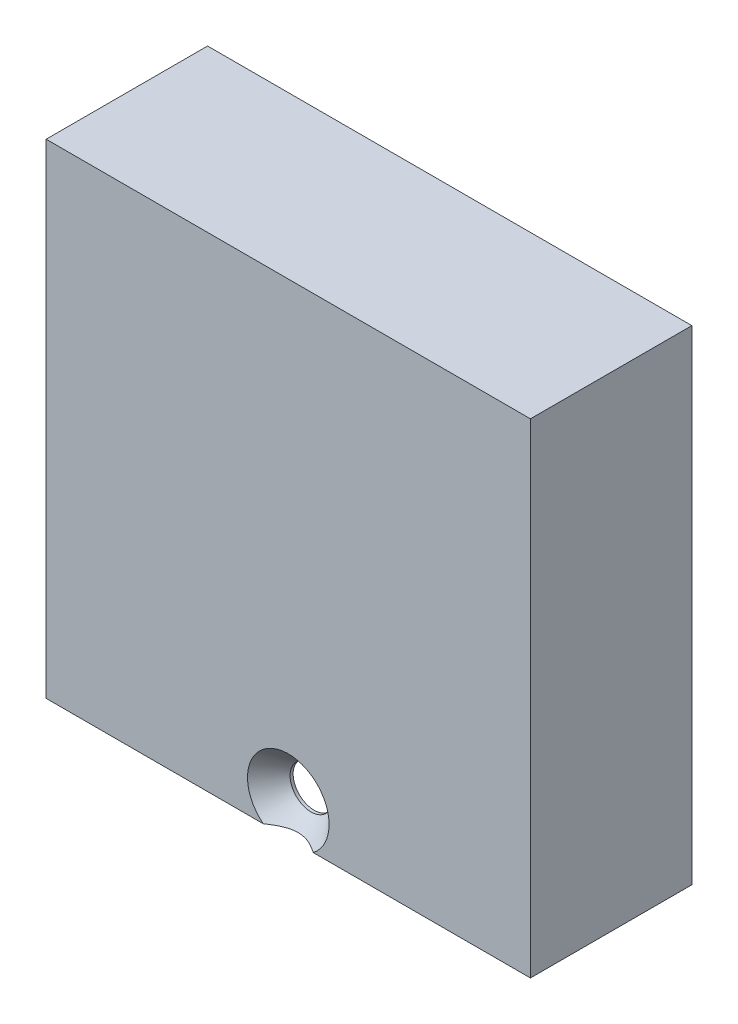
ISO-10303-21;
HEADER;
FILE_DESCRIPTION(('STEP AP214'),'2;1');
FILE_NAME('part.step','',(''),(''),'','','');
FILE_SCHEMA(('AUTOMOTIVE_DESIGN { 1 0 10303 214 1 1 1 1 }'));
ENDSEC;
DATA;
#1=APPLICATION_CONTEXT('core data for automotive mechanical design processes');
#2=APPLICATION_PROTOCOL_DEFINITION('international standard','automotive_design',2000,#1);
#3=PRODUCT_CONTEXT('',#1,'mechanical');
#4=PRODUCT('Part','Part','',(#3));
#5=PRODUCT_RELATED_PRODUCT_CATEGORY('part','',(#4));
#6=PRODUCT_DEFINITION_FORMATION('','',#4);
#7=PRODUCT_DEFINITION_CONTEXT('part definition',#1,'design');
#8=PRODUCT_DEFINITION('design','',#6,#7);
#9=PRODUCT_DEFINITION_SHAPE('','',#8);
#10=(LENGTH_UNIT() NAMED_UNIT(*) SI_UNIT(.MILLI.,.METRE.));
#11=(NAMED_UNIT(*) PLANE_ANGLE_UNIT() SI_UNIT($,.RADIAN.));
#12=(NAMED_UNIT(*) SI_UNIT($,.STERADIAN.) SOLID_ANGLE_UNIT());
#13=UNCERTAINTY_MEASURE_WITH_UNIT(LENGTH_MEASURE(1.E-05),#10,'distance_accuracy_value','');
#14=(GEOMETRIC_REPRESENTATION_CONTEXT(3) GLOBAL_UNCERTAINTY_ASSIGNED_CONTEXT((#13)) GLOBAL_UNIT_ASSIGNED_CONTEXT((#10,
#11,#12)) REPRESENTATION_CONTEXT('',''));
#15=CARTESIAN_POINT('',(0.,0.,0.));
#16=DIRECTION('',(0.,0.,1.));
#17=DIRECTION('',(1.,0.,0.));
#18=AXIS2_PLACEMENT_3D('',#15,#16,#17);
#19=CARTESIAN_POINT('',(0.,0.,10.));
#20=DIRECTION('',(0.,0.,-1.));
#21=DIRECTION('',(-1.,0.,0.));
#22=AXIS2_PLACEMENT_3D('',#19,#20,#21);
#23=PLANE('',#22);
#24=CARTESIAN_POINT('',(15.,2.,10.));
#25=DIRECTION('',(0.,0.,1.));
#26=DIRECTION('',(1.,0.,0.));
#27=AXIS2_PLACEMENT_3D('',#24,#25,#26);
#28=CIRCLE('',#27,2.5273);
#29=CARTESIAN_POINT('',(16.5450712896174,0.,10.));
#30=VERTEX_POINT('',#29);
#31=CARTESIAN_POINT('',(13.4549287103826,0.,10.));
#32=VERTEX_POINT('',#31);
#33=EDGE_CURVE('E47',#30,#32,#28,.T.);
#34=ORIENTED_EDGE('',*,*,#33,.F.);
#35=DIRECTION('',(1.,0.,0.));
#36=VECTOR('',#35,1.);
#37=CARTESIAN_POINT('',(0.,0.,10.));
#38=LINE('',#37,#36);
#39=CARTESIAN_POINT('',(30.,0.,10.));
#40=VERTEX_POINT('',#39);
#41=EDGE_CURVE('E153',#30,#40,#38,.T.);
#42=ORIENTED_EDGE('',*,*,#41,.T.);
#43=DIRECTION('',(0.,1.,0.));
#44=VECTOR('',#43,1.);
#45=CARTESIAN_POINT('',(30.,0.,10.));
#46=LINE('',#45,#44);
#47=CARTESIAN_POINT('',(30.,30.,10.));
#48=VERTEX_POINT('',#47);
#49=EDGE_CURVE('E165',#40,#48,#46,.T.);
#50=ORIENTED_EDGE('',*,*,#49,.T.);
#51=DIRECTION('',(-1.,0.,0.));
#52=VECTOR('',#51,1.);
#53=CARTESIAN_POINT('',(0.,30.,10.));
#54=LINE('',#53,#52);
#55=CARTESIAN_POINT('',(0.,30.,10.));
#56=VERTEX_POINT('',#55);
#57=EDGE_CURVE('E171',#48,#56,#54,.T.);
#58=ORIENTED_EDGE('',*,*,#57,.T.);
#59=DIRECTION('',(0.,-1.,0.));
#60=VECTOR('',#59,1.);
#61=CARTESIAN_POINT('',(0.,0.,10.));
#62=LINE('',#61,#60);
#63=CARTESIAN_POINT('',(0.,0.,10.));
#64=VERTEX_POINT('',#63);
#65=EDGE_CURVE('E163',#56,#64,#62,.T.);
#66=ORIENTED_EDGE('',*,*,#65,.T.);
#67=EDGE_CURVE('E156',#64,#32,#38,.T.);
#68=ORIENTED_EDGE('',*,*,#67,.T.);
#69=EDGE_LOOP('',(#34,#42,#50,#58,#66,#68));
#70=FACE_BOUND('',#69,.T.);
#71=ADVANCED_FACE('F32',(#70),#23,.F.);
#72=CARTESIAN_POINT('',(15.,15.5,-27.7353564967173));
#73=DIRECTION('',(0.,0.,1.));
#74=DIRECTION('',(1.,0.,0.));
#75=AXIS2_PLACEMENT_3D('',#72,#73,#74);
#76=CYLINDRICAL_SURFACE('',#75,12.25);
#77=DIRECTION('',(0.,0.,1.));
#78=VECTOR('',#77,1.);
#79=CARTESIAN_POINT('',(27.25,15.5,-27.7353564967173));
#80=LINE('',#79,#78);
#81=CARTESIAN_POINT('',(27.25,15.5,0.));
#82=VERTEX_POINT('',#81);
#83=CARTESIAN_POINT('',(27.25,15.5,5.20000000000001));
#84=VERTEX_POINT('',#83);
#85=EDGE_CURVE('E287',#82,#84,#80,.T.);
#86=ORIENTED_EDGE('',*,*,#85,.T.);
#87=CARTESIAN_POINT('',(15.,15.5,5.2));
#88=DIRECTION('',(0.,0.,1.));
#89=DIRECTION('',(1.,0.,0.));
#90=AXIS2_PLACEMENT_3D('',#87,#88,#89);
#91=CIRCLE('',#90,12.25);
#92=CARTESIAN_POINT('',(2.74999999999999,15.5,5.2));
#93=VERTEX_POINT('',#92);
#94=EDGE_CURVE('E298',#84,#93,#91,.T.);
#95=ORIENTED_EDGE('',*,*,#94,.T.);
#96=DIRECTION('',(0.,0.,1.));
#97=VECTOR('',#96,1.);
#98=CARTESIAN_POINT('',(2.74999999999999,15.5,-27.7353564967173));
#99=LINE('',#98,#97);
#100=CARTESIAN_POINT('',(2.74999999999999,15.5,0.));
#101=VERTEX_POINT('',#100);
#102=EDGE_CURVE('E292',#101,#93,#99,.T.);
#103=ORIENTED_EDGE('',*,*,#102,.F.);
#104=CARTESIAN_POINT('',(15.,15.5,0.));
#105=DIRECTION('',(0.,0.,-1.));
#106=DIRECTION('',(-1.,0.,0.));
#107=AXIS2_PLACEMENT_3D('',#104,#105,#106);
#108=CIRCLE('',#107,12.25);
#109=EDGE_CURVE('E288',#82,#101,#108,.F.);
#110=ORIENTED_EDGE('',*,*,#109,.F.);
#111=EDGE_LOOP('',(#86,#95,#103,#110));
#112=FACE_BOUND('',#111,.T.);
#113=ADVANCED_FACE('F216',(#112),#76,.F.);
#114=CARTESIAN_POINT('',(2.74999999999999,15.5,6.2));
#115=VERTEX_POINT('',#114);
#116=CARTESIAN_POINT('',(2.74999999999999,15.5,8.4));
#117=VERTEX_POINT('',#116);
#118=EDGE_CURVE('E286',#115,#117,#99,.T.);
#119=ORIENTED_EDGE('',*,*,#118,.F.);
#120=CARTESIAN_POINT('',(15.,15.5,6.20000000000001));
#121=DIRECTION('',(0.,0.,-1.));
#122=DIRECTION('',(-1.,0.,0.));
#123=AXIS2_PLACEMENT_3D('',#120,#121,#122);
#124=CIRCLE('',#123,12.25);
#125=CARTESIAN_POINT('',(27.25,15.5,6.2));
#126=VERTEX_POINT('',#125);
#127=EDGE_CURVE('E291',#115,#126,#124,.T.);
#128=ORIENTED_EDGE('',*,*,#127,.T.);
#129=CARTESIAN_POINT('',(27.25,15.5,8.4));
#130=VERTEX_POINT('',#129);
#131=EDGE_CURVE('E282',#126,#130,#80,.T.);
#132=ORIENTED_EDGE('',*,*,#131,.T.);
#133=CARTESIAN_POINT('',(15.,15.5,8.4));
#134=DIRECTION('',(0.,0.,1.));
#135=DIRECTION('',(1.,0.,0.));
#136=AXIS2_PLACEMENT_3D('',#133,#134,#135);
#137=CIRCLE('',#136,12.25);
#138=EDGE_CURVE('E283',#130,#117,#137,.T.);
#139=ORIENTED_EDGE('',*,*,#138,.T.);
#140=EDGE_LOOP('',(#119,#128,#132,#139));
#141=FACE_BOUND('',#140,.T.);
#142=ADVANCED_FACE('F249',(#141),#76,.F.);
#143=CARTESIAN_POINT('',(3.34999999999999,28.5,5.2));
#144=DIRECTION('',(-1.,0.,0.));
#145=DIRECTION('',(0.,0.,1.));
#146=AXIS2_PLACEMENT_3D('',#143,#144,#145);
#147=PLANE('',#146);
#148=DIRECTION('',(0.,0.,-1.));
#149=VECTOR('',#148,1.);
#150=CARTESIAN_POINT('',(3.34999999999999,0.,5.2));
#151=LINE('',#150,#149);
#152=CARTESIAN_POINT('',(3.34999999999999,0.,6.2));
#153=VERTEX_POINT('',#152);
#154=CARTESIAN_POINT('',(3.34999999999999,0.,5.2));
#155=VERTEX_POINT('',#154);
#156=EDGE_CURVE('E325',#153,#155,#151,.T.);
#157=ORIENTED_EDGE('',*,*,#156,.T.);
#158=DIRECTION('',(0.,-1.,0.));
#159=VECTOR('',#158,1.);
#160=CARTESIAN_POINT('',(3.34999999999999,28.5,5.2));
#161=LINE('',#160,#159);
#162=CARTESIAN_POINT('',(3.34999999999999,17.0297058540778,5.2));
#163=VERTEX_POINT('',#162);
#164=EDGE_CURVE('E54',#163,#155,#161,.T.);
#165=ORIENTED_EDGE('',*,*,#164,.F.);
#166=DIRECTION('',(0.,0.,-1.));
#167=VECTOR('',#166,1.);
#168=CARTESIAN_POINT('',(3.35000000000001,17.029705854078,40.2139893245156));
#169=LINE('',#168,#167);
#170=CARTESIAN_POINT('',(3.35,17.0297058540778,6.2));
#171=VERTEX_POINT('',#170);
#172=EDGE_CURVE('E280',#163,#171,#169,.F.);
#173=ORIENTED_EDGE('',*,*,#172,.T.);
#174=DIRECTION('',(0.,-1.,0.));
#175=VECTOR('',#174,1.);
#176=CARTESIAN_POINT('',(3.34999999999999,28.5,6.2));
#177=LINE('',#176,#175);
#178=EDGE_CURVE('E338',#171,#153,#177,.T.);
#179=ORIENTED_EDGE('',*,*,#178,.T.);
#180=EDGE_LOOP('',(#157,#165,#173,#179));
#181=FACE_BOUND('',#180,.T.);
#182=ADVANCED_FACE('F240',(#181),#147,.F.);
#183=CARTESIAN_POINT('',(2.74999999999999,28.5,8.4));
#184=DIRECTION('',(0.,0.,1.));
#185=DIRECTION('',(1.,0.,0.));
#186=AXIS2_PLACEMENT_3D('',#183,#184,#185);
#187=PLANE('',#186);
#188=CARTESIAN_POINT('',(15.,2.,8.4));
#189=DIRECTION('',(0.,0.,1.));
#190=DIRECTION('',(1.,0.,0.));
#191=AXIS2_PLACEMENT_3D('',#188,#189,#190);
#192=CIRCLE('',#191,1.29999739999999);
#193=CARTESIAN_POINT('',(16.2999974,2.,8.4));
#194=VERTEX_POINT('',#193);
#195=EDGE_CURVE('E36',#194,#194,#192,.T.);
#196=ORIENTED_EDGE('',*,*,#195,.T.);
#197=EDGE_LOOP('',(#196));
#198=FACE_BOUND('',#197,.T.);
#199=ORIENTED_EDGE('',*,*,#138,.F.);
#200=DIRECTION('',(0.,-1.,0.));
#201=VECTOR('',#200,1.);
#202=CARTESIAN_POINT('',(27.25,28.5,8.4));
#203=LINE('',#202,#201);
#204=CARTESIAN_POINT('',(27.25,0.,8.4));
#205=VERTEX_POINT('',#204);
#206=EDGE_CURVE('E344',#130,#205,#203,.T.);
#207=ORIENTED_EDGE('',*,*,#206,.T.);
#208=DIRECTION('',(-1.,0.,0.));
#209=VECTOR('',#208,1.);
#210=CARTESIAN_POINT('',(2.74999999999999,0.,8.4));
#211=LINE('',#210,#209);
#212=CARTESIAN_POINT('',(2.74999999999999,0.,8.4));
#213=VERTEX_POINT('',#212);
#214=EDGE_CURVE('E316',#205,#213,#211,.T.);
#215=ORIENTED_EDGE('',*,*,#214,.T.);
#216=DIRECTION('',(0.,-1.,0.));
#217=VECTOR('',#216,1.);
#218=CARTESIAN_POINT('',(2.74999999999999,28.5,8.4));
#219=LINE('',#218,#217);
#220=EDGE_CURVE('E342',#117,#213,#219,.T.);
#221=ORIENTED_EDGE('',*,*,#220,.F.);
#222=EDGE_LOOP('',(#199,#207,#215,#221));
#223=FACE_BOUND('',#222,.T.);
#224=ADVANCED_FACE('F236',(#198,#223),#187,.F.);
#225=CARTESIAN_POINT('',(27.25,28.5,8.4));
#226=DIRECTION('',(1.,0.,0.));
#227=DIRECTION('',(0.,0.,-1.));
#228=AXIS2_PLACEMENT_3D('',#225,#226,#227);
#229=PLANE('',#228);
#230=ORIENTED_EDGE('',*,*,#131,.F.);
#231=DIRECTION('',(0.,-1.,0.));
#232=VECTOR('',#231,1.);
#233=CARTESIAN_POINT('',(27.25,28.5,6.2));
#234=LINE('',#233,#232);
#235=CARTESIAN_POINT('',(27.25,0.,6.2));
#236=VERTEX_POINT('',#235);
#237=EDGE_CURVE('E346',#126,#236,#234,.T.);
#238=ORIENTED_EDGE('',*,*,#237,.T.);
#239=DIRECTION('',(0.,0.,1.));
#240=VECTOR('',#239,1.);
#241=CARTESIAN_POINT('',(27.25,0.,8.4));
#242=LINE('',#241,#240);
#243=EDGE_CURVE('E313',#236,#205,#242,.T.);
#244=ORIENTED_EDGE('',*,*,#243,.T.);
#245=ORIENTED_EDGE('',*,*,#206,.F.);
#246=EDGE_LOOP('',(#230,#238,#244,#245));
#247=FACE_BOUND('',#246,.T.);
#248=ADVANCED_FACE('F232',(#247),#229,.F.);
#249=CARTESIAN_POINT('',(27.25,28.5,6.2));
#250=DIRECTION('',(0.,0.,-1.));
#251=DIRECTION('',(-1.,0.,0.));
#252=AXIS2_PLACEMENT_3D('',#249,#250,#251);
#253=PLANE('',#252);
#254=DIRECTION('',(1.,0.,0.));
#255=VECTOR('',#254,1.);
#256=CARTESIAN_POINT('',(27.25,0.,6.2));
#257=LINE('',#256,#255);
#258=CARTESIAN_POINT('',(26.65,0.,6.2));
#259=VERTEX_POINT('',#258);
#260=EDGE_CURVE('E310',#259,#236,#257,.T.);
#261=ORIENTED_EDGE('',*,*,#260,.T.);
#262=ORIENTED_EDGE('',*,*,#237,.F.);
#263=ORIENTED_EDGE('',*,*,#127,.F.);
#264=DIRECTION('',(0.,-1.,0.));
#265=VECTOR('',#264,1.);
#266=CARTESIAN_POINT('',(2.74999999999999,28.5,6.2));
#267=LINE('',#266,#265);
#268=CARTESIAN_POINT('',(2.74999999999999,0.,6.2));
#269=VERTEX_POINT('',#268);
#270=EDGE_CURVE('E340',#115,#269,#267,.T.);
#271=ORIENTED_EDGE('',*,*,#270,.T.);
#272=DIRECTION('',(1.,0.,0.));
#273=VECTOR('',#272,1.);
#274=CARTESIAN_POINT('',(3.34999999999999,0.,6.2));
#275=LINE('',#274,#273);
#276=EDGE_CURVE('E322',#269,#153,#275,.T.);
#277=ORIENTED_EDGE('',*,*,#276,.T.);
#278=ORIENTED_EDGE('',*,*,#178,.F.);
#279=CARTESIAN_POINT('',(15.,15.5,6.2));
#280=DIRECTION('',(0.,0.,-1.));
#281=DIRECTION('',(-1.,0.,0.));
#282=AXIS2_PLACEMENT_3D('',#279,#280,#281);
#283=CIRCLE('',#282,11.75);
#284=CARTESIAN_POINT('',(26.65,17.0297058540778,6.2));
#285=VERTEX_POINT('',#284);
#286=EDGE_CURVE('E272',#171,#285,#283,.T.);
#287=ORIENTED_EDGE('',*,*,#286,.T.);
#288=DIRECTION('',(0.,-1.,0.));
#289=VECTOR('',#288,1.);
#290=CARTESIAN_POINT('',(26.65,28.5,6.2));
#291=LINE('',#290,#289);
#292=EDGE_CURVE('E348',#285,#259,#291,.T.);
#293=ORIENTED_EDGE('',*,*,#292,.T.);
#294=EDGE_LOOP('',(#261,#262,#263,#271,#277,#278,#287,#293));
#295=FACE_BOUND('',#294,.T.);
#296=ADVANCED_FACE('F228',(#295),#253,.F.);
#297=CARTESIAN_POINT('',(26.65,28.5,6.2));
#298=DIRECTION('',(1.,0.,0.));
#299=DIRECTION('',(0.,0.,-1.));
#300=AXIS2_PLACEMENT_3D('',#297,#298,#299);
#301=PLANE('',#300);
#302=DIRECTION('',(0.,0.,1.));
#303=VECTOR('',#302,1.);
#304=CARTESIAN_POINT('',(26.65,0.,6.2));
#305=LINE('',#304,#303);
#306=CARTESIAN_POINT('',(26.65,0.,5.20000000000001));
#307=VERTEX_POINT('',#306);
#308=EDGE_CURVE('E307',#307,#259,#305,.T.);
#309=ORIENTED_EDGE('',*,*,#308,.T.);
#310=ORIENTED_EDGE('',*,*,#292,.F.);
#311=DIRECTION('',(0.,0.,-1.));
#312=VECTOR('',#311,1.);
#313=CARTESIAN_POINT('',(26.65,17.0297058540779,40.2139893245156));
#314=LINE('',#313,#312);
#315=CARTESIAN_POINT('',(26.65,17.0297058540778,5.2));
#316=VERTEX_POINT('',#315);
#317=EDGE_CURVE('E277',#285,#316,#314,.T.);
#318=ORIENTED_EDGE('',*,*,#317,.T.);
#319=DIRECTION('',(0.,-1.,0.));
#320=VECTOR('',#319,1.);
#321=CARTESIAN_POINT('',(26.65,28.5,5.20000000000001));
#322=LINE('',#321,#320);
#323=EDGE_CURVE('E350',#316,#307,#322,.T.);
#324=ORIENTED_EDGE('',*,*,#323,.T.);
#325=EDGE_LOOP('',(#309,#310,#318,#324));
#326=FACE_BOUND('',#325,.T.);
#327=ADVANCED_FACE('F224',(#326),#301,.F.);
#328=CARTESIAN_POINT('',(26.65,28.5,5.20000000000001));
#329=DIRECTION('',(0.,0.,1.));
#330=DIRECTION('',(1.,0.,0.));
#331=AXIS2_PLACEMENT_3D('',#328,#329,#330);
#332=PLANE('',#331);
#333=DIRECTION('',(-1.,0.,0.));
#334=VECTOR('',#333,1.);
#335=CARTESIAN_POINT('',(26.65,0.,5.20000000000001));
#336=LINE('',#335,#334);
#337=CARTESIAN_POINT('',(27.25,0.,5.20000000000001));
#338=VERTEX_POINT('',#337);
#339=EDGE_CURVE('E304',#338,#307,#336,.T.);
#340=ORIENTED_EDGE('',*,*,#339,.T.);
#341=ORIENTED_EDGE('',*,*,#323,.F.);
#342=CARTESIAN_POINT('',(15.,15.5,5.20000000000001));
#343=DIRECTION('',(0.,0.,1.));
#344=DIRECTION('',(1.,0.,0.));
#345=AXIS2_PLACEMENT_3D('',#342,#343,#344);
#346=CIRCLE('',#345,11.75);
#347=EDGE_CURVE('E270',#316,#163,#346,.T.);
#348=ORIENTED_EDGE('',*,*,#347,.T.);
#349=ORIENTED_EDGE('',*,*,#164,.T.);
#350=DIRECTION('',(-1.,0.,0.));
#351=VECTOR('',#350,1.);
#352=CARTESIAN_POINT('',(2.74999999999999,0.,5.2));
#353=LINE('',#352,#351);
#354=CARTESIAN_POINT('',(2.74999999999999,0.,5.2));
#355=VERTEX_POINT('',#354);
#356=EDGE_CURVE('E327',#155,#355,#353,.T.);
#357=ORIENTED_EDGE('',*,*,#356,.T.);
#358=DIRECTION('',(0.,-1.,0.));
#359=VECTOR('',#358,1.);
#360=CARTESIAN_POINT('',(2.74999999999999,28.5,5.2));
#361=LINE('',#360,#359);
#362=EDGE_CURVE('E335',#93,#355,#361,.T.);
#363=ORIENTED_EDGE('',*,*,#362,.F.);
#364=ORIENTED_EDGE('',*,*,#94,.F.);
#365=DIRECTION('',(0.,-1.,0.));
#366=VECTOR('',#365,1.);
#367=CARTESIAN_POINT('',(27.25,28.5,5.20000000000001));
#368=LINE('',#367,#366);
#369=EDGE_CURVE('E352',#84,#338,#368,.T.);
#370=ORIENTED_EDGE('',*,*,#369,.T.);
#371=EDGE_LOOP('',(#340,#341,#348,#349,#357,#363,#364,#370));
#372=FACE_BOUND('',#371,.T.);
#373=ADVANCED_FACE('F220',(#372),#332,.F.);
#374=CARTESIAN_POINT('',(27.25,28.5,5.20000000000001));
#375=DIRECTION('',(1.,0.,0.));
#376=DIRECTION('',(0.,0.,-1.));
#377=AXIS2_PLACEMENT_3D('',#374,#375,#376);
#378=PLANE('',#377);
#379=ORIENTED_EDGE('',*,*,#85,.F.);
#380=DIRECTION('',(0.,-1.,0.));
#381=VECTOR('',#380,1.);
#382=CARTESIAN_POINT('',(27.25,28.5,0.));
#383=LINE('',#382,#381);
#384=CARTESIAN_POINT('',(27.25,0.,0.));
#385=VERTEX_POINT('',#384);
#386=EDGE_CURVE('E333',#82,#385,#383,.T.);
#387=ORIENTED_EDGE('',*,*,#386,.T.);
#388=DIRECTION('',(0.,0.,1.));
#389=VECTOR('',#388,1.);
#390=CARTESIAN_POINT('',(27.25,0.,5.20000000000001));
#391=LINE('',#390,#389);
#392=EDGE_CURVE('E301',#385,#338,#391,.T.);
#393=ORIENTED_EDGE('',*,*,#392,.T.);
#394=ORIENTED_EDGE('',*,*,#369,.F.);
#395=EDGE_LOOP('',(#379,#387,#393,#394));
#396=FACE_BOUND('',#395,.T.);
#397=ADVANCED_FACE('F217',(#396),#378,.F.);
#398=CARTESIAN_POINT('',(0.,0.,10.));
#399=DIRECTION('',(1.,0.,0.));
#400=DIRECTION('',(0.,0.,-1.));
#401=AXIS2_PLACEMENT_3D('',#398,#399,#400);
#402=PLANE('',#401);
#403=DIRECTION('',(0.,0.,-1.));
#404=VECTOR('',#403,1.);
#405=CARTESIAN_POINT('',(0.,30.,10.));
#406=LINE('',#405,#404);
#407=CARTESIAN_POINT('',(0.,30.,0.));
#408=VERTEX_POINT('',#407);
#409=EDGE_CURVE('E173',#56,#408,#406,.T.);
#410=ORIENTED_EDGE('',*,*,#409,.T.);
#411=DIRECTION('',(0.,-1.,0.));
#412=VECTOR('',#411,1.);
#413=CARTESIAN_POINT('',(0.,0.,0.));
#414=LINE('',#413,#412);
#415=CARTESIAN_POINT('',(0.,0.,0.));
#416=VERTEX_POINT('',#415);
#417=EDGE_CURVE('E174',#408,#416,#414,.T.);
#418=ORIENTED_EDGE('',*,*,#417,.T.);
#419=DIRECTION('',(0.,0.,-1.));
#420=VECTOR('',#419,1.);
#421=CARTESIAN_POINT('',(0.,0.,10.));
#422=LINE('',#421,#420);
#423=EDGE_CURVE('E41',#64,#416,#422,.T.);
#424=ORIENTED_EDGE('',*,*,#423,.F.);
#425=ORIENTED_EDGE('',*,*,#65,.F.);
#426=EDGE_LOOP('',(#410,#418,#424,#425));
#427=FACE_BOUND('',#426,.T.);
#428=ADVANCED_FACE('F34',(#427),#402,.F.);
#429=CARTESIAN_POINT('',(0.,0.,10.));
#430=DIRECTION('',(0.,1.,0.));
#431=DIRECTION('',(0.,0.,1.));
#432=AXIS2_PLACEMENT_3D('',#429,#430,#431);
#433=PLANE('',#432);
#434=ORIENTED_EDGE('',*,*,#41,.F.);
#435=CARTESIAN_POINT('',(11.1114371868545,0.,12.1229445081594));
#436=CARTESIAN_POINT('',(11.1994048959017,0.,12.0329682086159));
#437=CARTESIAN_POINT('',(11.2876800097042,0.,11.9432896436454));
#438=CARTESIAN_POINT('',(11.4650079386643,0.,11.7646861417897));
#439=CARTESIAN_POINT('',(11.5540608360429,0.,11.6757612865874));
#440=CARTESIAN_POINT('',(11.7334794492326,0.,11.4984563114402));
#441=CARTESIAN_POINT('',(11.8238492003111,0.,11.4100802674217));
#442=CARTESIAN_POINT('',(12.0057271312656,0.,11.2345146480709));
#443=CARTESIAN_POINT('',(12.097235253264,0.,11.1473250128869));
#444=CARTESIAN_POINT('',(12.2866602604051,0.,10.9697792825746));
#445=CARTESIAN_POINT('',(12.3846560180281,0.,10.8795070958733));
#446=CARTESIAN_POINT('',(12.582655005403,0.,10.7011939694588));
#447=CARTESIAN_POINT('',(12.6826581082197,0.,10.6131528894522));
#448=CARTESIAN_POINT('',(12.8850970109053,0.,10.4402695767215));
#449=CARTESIAN_POINT('',(12.9875281768567,0.,10.3554219425911));
#450=CARTESIAN_POINT('',(13.1957870118897,0.,10.1900259018531));
#451=CARTESIAN_POINT('',(13.301613404013,0.,10.1094759085474));
#452=CARTESIAN_POINT('',(13.4790643937067,0.,9.9824389917061));
#453=CARTESIAN_POINT('',(13.5493515653551,0.,9.93409162983542));
#454=CARTESIAN_POINT('',(13.6921993117033,0.,9.84079693769277));
#455=CARTESIAN_POINT('',(13.7647606513366,0.,9.79585076917719));
#456=CARTESIAN_POINT('',(13.9120627759516,0.,9.71076227202651));
#457=CARTESIAN_POINT('',(13.9867865333265,0.,9.67059089435542));
#458=CARTESIAN_POINT('',(14.139115789913,0.,9.5962406230169));
#459=CARTESIAN_POINT('',(14.2167194041308,0.,9.56205789051825));
#460=CARTESIAN_POINT('',(14.3966519786094,0.,9.4933512223617));
#461=CARTESIAN_POINT('',(14.4999668784266,0.,9.46126129246796));
#462=CARTESIAN_POINT('',(14.6576594165183,0.,9.42611711168004));
#463=CARTESIAN_POINT('',(14.7106160800208,0.,9.41657095607505));
#464=CARTESIAN_POINT('',(14.8171576176156,0.,9.40220574899829));
#465=CARTESIAN_POINT('',(14.8707421820199,0.,9.39738445889837));
#466=CARTESIAN_POINT('',(14.9784680508456,0.,9.39270541125794));
#467=CARTESIAN_POINT('',(15.0326107353041,0.,9.39287914299207));
#468=CARTESIAN_POINT('',(15.1406422295118,0.,9.39825657935433));
#469=CARTESIAN_POINT('',(15.19453103802,0.,9.40346030854407));
#470=CARTESIAN_POINT('',(15.3017434965084,0.,9.41864121924035));
#471=CARTESIAN_POINT('',(15.3550656488372,0.,9.42862883853239));
#472=CARTESIAN_POINT('',(15.4607255527648,0.,9.45291614453212));
#473=CARTESIAN_POINT('',(15.5130628903025,0.,9.46721760375903));
#474=CARTESIAN_POINT('',(15.6428156444909,0.,9.50778362474929));
#475=CARTESIAN_POINT('',(15.7194839622931,0.,9.53643653881158));
#476=CARTESIAN_POINT('',(15.8699954776387,0.,9.6003680639219));
#477=CARTESIAN_POINT('',(15.943836678134,0.,9.63565125825406));
#478=CARTESIAN_POINT('',(16.0896670306823,0.,9.71165188165242));
#479=CARTESIAN_POINT('',(16.1616271825189,0.,9.7524244055177));
#480=CARTESIAN_POINT('',(16.2677706501169,0.,9.81648275211381));
#481=CARTESIAN_POINT('',(16.3028468839573,0.,9.83831507391825));
#482=CARTESIAN_POINT('',(16.3724538129443,0.,9.88283143815528));
#483=CARTESIAN_POINT('',(16.4069845254132,0.,9.90551545346586));
#484=CARTESIAN_POINT('',(16.518353238973,0.,9.9804139226146));
#485=CARTESIAN_POINT('',(16.5941800228755,0.,10.0341340220716));
#486=CARTESIAN_POINT('',(16.7437670347679,0.,10.1443893012535));
#487=CARTESIAN_POINT('',(16.8175267341621,0.,10.2009251909514));
#488=CARTESIAN_POINT('',(16.9633995835785,0.,10.3161954006317));
#489=CARTESIAN_POINT('',(17.0355113438687,0.,10.3749314733531));
#490=CARTESIAN_POINT('',(17.1783294213125,0.,10.4940918665243));
#491=CARTESIAN_POINT('',(17.2490356317369,0.,10.5545163143475));
#492=CARTESIAN_POINT('',(17.4599926240846,0.,10.7382803569823));
#493=CARTESIAN_POINT('',(17.5984886573298,0.,10.8636323066131));
#494=CARTESIAN_POINT('',(17.8721418741623,0.,11.117768125302));
#495=CARTESIAN_POINT('',(18.0073005935122,0.,11.246550356879));
#496=CARTESIAN_POINT('',(18.2613193371269,0.,11.4930484739259));
#497=CARTESIAN_POINT('',(18.3804135409139,0.,11.6105236710317));
#498=CARTESIAN_POINT('',(18.617149825235,0.,11.8469571778974));
#499=CARTESIAN_POINT('',(18.7347917042118,0.,11.9659156890113));
#500=CARTESIAN_POINT('',(18.967911686774,0.,12.2039168565331));
#501=CARTESIAN_POINT('',(19.0833997087372,0.,12.3229498158848));
#502=CARTESIAN_POINT('',(19.313440928588,0.,12.5618714158584));
#503=CARTESIAN_POINT('',(19.427994304566,0.,12.6817598849025));
#504=CARTESIAN_POINT('',(19.5421992104668,0.,12.8019760492558));
#505=B_SPLINE_CURVE_WITH_KNOTS('',3,(#435,#436,#437,#438,#439,#440,#441,#442,#443,#444,#445,
#446,#447,#448,#449,#450,#451,#452,#453,#454,#455,#456,#457,#458,#459,#460,#461,#462,#463,#464,
#465,#466,#467,#468,#469,#470,#471,#472,#473,#474,#475,#476,#477,#478,#479,#480,#481,#482,#483,
#484,#485,#486,#487,#488,#489,#490,#491,#492,#493,#494,#495,#496,#497,#498,#499,#500,#501,#502,
#503,#504),.UNSPECIFIED.,.F.,.F.,(4,2,2,2,2,2,2,2,2,2,2,2,2,2,2,2,2,2,2,2,2,2,2,2,2,2,2,2,2,2,2,
2,2,2,4),(0.,0.377502560301374,0.755045522169459,1.13423755965705,1.51341039627723,
1.91309808125857,2.31276057094308,2.71171354385906,3.11051818849775,3.36637315785739,
3.62231512958491,3.87661026540647,4.13074179216813,4.45396698499053,4.61521846864986,
4.77639351481312,4.93858485115462,5.10077697948466,5.26332461183465,5.42593912478142,
5.67104810999645,5.91632715807356,6.16428256812886,6.28822066678579,6.41215482200093,
6.69084063854107,6.96959708218542,7.24858052318782,7.52758506822869,8.08787832437938,
8.64790874958178,9.14974307652357,9.65164628362322,10.1491920239833,10.6466406360612),.UNSPECIFIED.);
#506=EDGE_CURVE('E11',#30,#32,#505,.F.);
#507=ORIENTED_EDGE('',*,*,#506,.T.);
#508=ORIENTED_EDGE('',*,*,#67,.F.);
#509=ORIENTED_EDGE('',*,*,#423,.T.);
#510=DIRECTION('',(1.,0.,0.));
#511=VECTOR('',#510,1.);
#512=CARTESIAN_POINT('',(0.,0.,0.));
#513=LINE('',#512,#511);
#514=CARTESIAN_POINT('',(2.74999999999999,0.,0.));
#515=VERTEX_POINT('',#514);
#516=EDGE_CURVE('E179',#416,#515,#513,.T.);
#517=ORIENTED_EDGE('',*,*,#516,.T.);
#518=DIRECTION('',(0.,0.,-1.));
#519=VECTOR('',#518,1.);
#520=CARTESIAN_POINT('',(2.74999999999999,0.,0.));
#521=LINE('',#520,#519);
#522=EDGE_CURVE('E330',#355,#515,#521,.T.);
#523=ORIENTED_EDGE('',*,*,#522,.F.);
#524=ORIENTED_EDGE('',*,*,#356,.F.);
#525=ORIENTED_EDGE('',*,*,#156,.F.);
#526=ORIENTED_EDGE('',*,*,#276,.F.);
#527=DIRECTION('',(0.,0.,-1.));
#528=VECTOR('',#527,1.);
#529=CARTESIAN_POINT('',(2.74999999999999,0.,6.2));
#530=LINE('',#529,#528);
#531=EDGE_CURVE('E319',#213,#269,#530,.T.);
#532=ORIENTED_EDGE('',*,*,#531,.F.);
#533=ORIENTED_EDGE('',*,*,#214,.F.);
#534=ORIENTED_EDGE('',*,*,#243,.F.);
#535=ORIENTED_EDGE('',*,*,#260,.F.);
#536=ORIENTED_EDGE('',*,*,#308,.F.);
#537=ORIENTED_EDGE('',*,*,#339,.F.);
#538=ORIENTED_EDGE('',*,*,#392,.F.);
#539=CARTESIAN_POINT('',(30.,0.,0.));
#540=VERTEX_POINT('',#539);
#541=EDGE_CURVE('E177',#385,#540,#513,.T.);
#542=ORIENTED_EDGE('',*,*,#541,.T.);
#543=DIRECTION('',(0.,0.,-1.));
#544=VECTOR('',#543,1.);
#545=CARTESIAN_POINT('',(30.,0.,10.));
#546=LINE('',#545,#544);
#547=EDGE_CURVE('E161',#40,#540,#546,.T.);
#548=ORIENTED_EDGE('',*,*,#547,.F.);
#549=EDGE_LOOP('',(#434,#507,#508,#509,#517,#523,#524,#525,#526,#532,#533,#534,#535,#536,#537,
#538,#542,#548));
#550=FACE_BOUND('',#549,.T.);
#551=ADVANCED_FACE('F159',(#550),#433,.F.);
#552=CARTESIAN_POINT('',(30.,0.,10.));
#553=DIRECTION('',(-1.,0.,0.));
#554=DIRECTION('',(0.,0.,1.));
#555=AXIS2_PLACEMENT_3D('',#552,#553,#554);
#556=PLANE('',#555);
#557=DIRECTION('',(0.,1.,0.));
#558=VECTOR('',#557,1.);
#559=CARTESIAN_POINT('',(30.,0.,0.));
#560=LINE('',#559,#558);
#561=CARTESIAN_POINT('',(30.,30.,0.));
#562=VERTEX_POINT('',#561);
#563=EDGE_CURVE('E182',#540,#562,#560,.T.);
#564=ORIENTED_EDGE('',*,*,#563,.T.);
#565=DIRECTION('',(0.,0.,-1.));
#566=VECTOR('',#565,1.);
#567=CARTESIAN_POINT('',(30.,30.,10.));
#568=LINE('',#567,#566);
#569=EDGE_CURVE('E188',#48,#562,#568,.T.);
#570=ORIENTED_EDGE('',*,*,#569,.F.);
#571=ORIENTED_EDGE('',*,*,#49,.F.);
#572=ORIENTED_EDGE('',*,*,#547,.T.);
#573=EDGE_LOOP('',(#564,#570,#571,#572));
#574=FACE_BOUND('',#573,.T.);
#575=ADVANCED_FACE('F201',(#574),#556,.F.);
#576=CARTESIAN_POINT('',(0.,30.,10.));
#577=DIRECTION('',(0.,-1.,0.));
#578=DIRECTION('',(0.,0.,-1.));
#579=AXIS2_PLACEMENT_3D('',#576,#577,#578);
#580=PLANE('',#579);
#581=ORIENTED_EDGE('',*,*,#569,.T.);
#582=DIRECTION('',(-1.,0.,0.));
#583=VECTOR('',#582,1.);
#584=CARTESIAN_POINT('',(0.,30.,0.));
#585=LINE('',#584,#583);
#586=EDGE_CURVE('E166',#562,#408,#585,.T.);
#587=ORIENTED_EDGE('',*,*,#586,.T.);
#588=ORIENTED_EDGE('',*,*,#409,.F.);
#589=ORIENTED_EDGE('',*,*,#57,.F.);
#590=EDGE_LOOP('',(#581,#587,#588,#589));
#591=FACE_BOUND('',#590,.T.);
#592=ADVANCED_FACE('F204',(#591),#580,.F.);
#593=CARTESIAN_POINT('',(0.,0.,0.));
#594=DIRECTION('',(0.,0.,-1.));
#595=DIRECTION('',(-1.,0.,0.));
#596=AXIS2_PLACEMENT_3D('',#593,#594,#595);
#597=PLANE('',#596);
#598=ORIENTED_EDGE('',*,*,#109,.T.);
#599=DIRECTION('',(0.,-1.,0.));
#600=VECTOR('',#599,1.);
#601=CARTESIAN_POINT('',(2.74999999999999,28.5,0.));
#602=LINE('',#601,#600);
#603=EDGE_CURVE('E178',#101,#515,#602,.T.);
#604=ORIENTED_EDGE('',*,*,#603,.T.);
#605=ORIENTED_EDGE('',*,*,#516,.F.);
#606=ORIENTED_EDGE('',*,*,#417,.F.);
#607=ORIENTED_EDGE('',*,*,#586,.F.);
#608=ORIENTED_EDGE('',*,*,#563,.F.);
#609=ORIENTED_EDGE('',*,*,#541,.F.);
#610=ORIENTED_EDGE('',*,*,#386,.F.);
#611=EDGE_LOOP('',(#598,#604,#605,#606,#607,#608,#609,#610));
#612=FACE_BOUND('',#611,.T.);
#613=ADVANCED_FACE('F208',(#612),#597,.T.);
#614=CARTESIAN_POINT('',(2.74999999999999,28.5,0.));
#615=DIRECTION('',(-1.,0.,0.));
#616=DIRECTION('',(0.,0.,1.));
#617=AXIS2_PLACEMENT_3D('',#614,#615,#616);
#618=PLANE('',#617);
#619=ORIENTED_EDGE('',*,*,#603,.F.);
#620=ORIENTED_EDGE('',*,*,#102,.T.);
#621=ORIENTED_EDGE('',*,*,#362,.T.);
#622=ORIENTED_EDGE('',*,*,#522,.T.);
#623=EDGE_LOOP('',(#619,#620,#621,#622));
#624=FACE_BOUND('',#623,.T.);
#625=ADVANCED_FACE('F212',(#624),#618,.F.);
#626=CARTESIAN_POINT('',(2.74999999999999,28.5,6.2));
#627=DIRECTION('',(-1.,0.,0.));
#628=DIRECTION('',(0.,0.,1.));
#629=AXIS2_PLACEMENT_3D('',#626,#627,#628);
#630=PLANE('',#629);
#631=ORIENTED_EDGE('',*,*,#270,.F.);
#632=ORIENTED_EDGE('',*,*,#118,.T.);
#633=ORIENTED_EDGE('',*,*,#220,.T.);
#634=ORIENTED_EDGE('',*,*,#531,.T.);
#635=EDGE_LOOP('',(#631,#632,#633,#634));
#636=FACE_BOUND('',#635,.T.);
#637=ADVANCED_FACE('F242',(#636),#630,.F.);
#638=CARTESIAN_POINT('',(15.,15.5,40.2139893245156));
#639=DIRECTION('',(0.,0.,-1.));
#640=DIRECTION('',(-1.,0.,0.));
#641=AXIS2_PLACEMENT_3D('',#638,#639,#640);
#642=CYLINDRICAL_SURFACE('',#641,11.75);
#643=ORIENTED_EDGE('',*,*,#172,.F.);
#644=ORIENTED_EDGE('',*,*,#347,.F.);
#645=ORIENTED_EDGE('',*,*,#317,.F.);
#646=ORIENTED_EDGE('',*,*,#286,.F.);
#647=EDGE_LOOP('',(#643,#644,#645,#646));
#648=FACE_BOUND('',#647,.T.);
#649=ADVANCED_FACE('F245',(#648),#642,.F.);
#650=CARTESIAN_POINT('',(15.,2.,10.));
#651=DIRECTION('',(0.,0.,1.));
#652=DIRECTION('',(1.,0.,0.));
#653=AXIS2_PLACEMENT_3D('',#650,#651,#652);
#654=CYLINDRICAL_SURFACE('',#653,1.29999739999999);
#655=CARTESIAN_POINT('',(15.,2.,8.58814986285978));
#656=DIRECTION('',(0.,0.,1.));
#657=DIRECTION('',(1.,0.,0.));
#658=AXIS2_PLACEMENT_3D('',#655,#656,#657);
#659=CIRCLE('',#658,1.29999739999999);
#660=CARTESIAN_POINT('',(16.2999974,2.,8.58814986285978));
#661=VERTEX_POINT('',#660);
#662=EDGE_CURVE('E157',#661,#661,#659,.T.);
#663=ORIENTED_EDGE('',*,*,#662,.T.);
#664=EDGE_LOOP('',(#663));
#665=FACE_BOUND('',#664,.T.);
#666=ORIENTED_EDGE('',*,*,#195,.F.);
#667=EDGE_LOOP('',(#666));
#668=FACE_BOUND('',#667,.T.);
#669=ADVANCED_FACE('F257',(#665,#668),#654,.F.);
#670=CARTESIAN_POINT('',(15.,2.,10.));
#671=DIRECTION('',(0.,0.,1.));
#672=DIRECTION('',(1.,0.,0.));
#673=AXIS2_PLACEMENT_3D('',#670,#671,#672);
#674=CONICAL_SURFACE('',#673,2.5273,0.715584993317674);
#675=ORIENTED_EDGE('',*,*,#662,.F.);
#676=EDGE_LOOP('',(#675));
#677=FACE_BOUND('',#676,.T.);
#678=ORIENTED_EDGE('',*,*,#33,.T.);
#679=ORIENTED_EDGE('',*,*,#506,.F.);
#680=EDGE_LOOP('',(#678,#679));
#681=FACE_BOUND('',#680,.T.);
#682=ADVANCED_FACE('F148',(#677,#681),#674,.F.);
#683=CLOSED_SHELL('',(#71,#113,#142,#182,#224,#248,#296,#327,#373,#397,#428,#551,#575,#592,#613,
#625,#637,#649,#669,#682));
#684=MANIFOLD_SOLID_BREP('B2',#683);
#685=ADVANCED_BREP_SHAPE_REPRESENTATION('',(#18,#684),#14);
#686=SHAPE_DEFINITION_REPRESENTATION(#9,#685);
ENDSEC;
END-ISO-10303-21;
